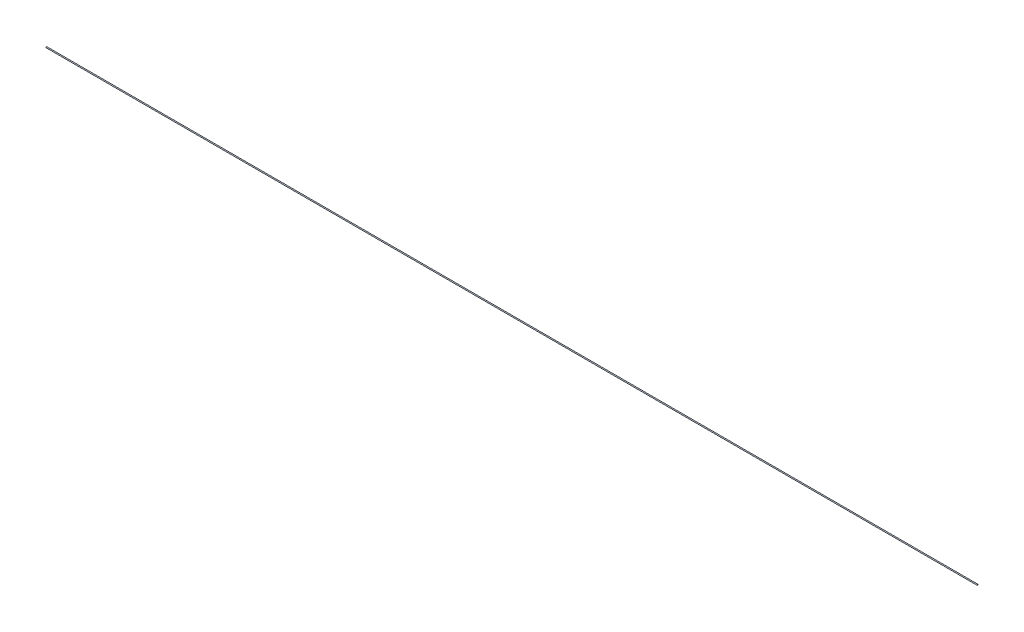
ISO-10303-21;
HEADER;
FILE_DESCRIPTION(('STEP AP214'),'2;1');
FILE_NAME('part.step','',(''),(''),'','','');
FILE_SCHEMA(('AUTOMOTIVE_DESIGN { 1 0 10303 214 1 1 1 1 }'));
ENDSEC;
DATA;
#1=APPLICATION_CONTEXT('core data for automotive mechanical design processes');
#2=APPLICATION_PROTOCOL_DEFINITION('international standard','automotive_design',2000,#1);
#3=PRODUCT_CONTEXT('',#1,'mechanical');
#4=PRODUCT('Part','Part','',(#3));
#5=PRODUCT_RELATED_PRODUCT_CATEGORY('part','',(#4));
#6=PRODUCT_DEFINITION_FORMATION('','',#4);
#7=PRODUCT_DEFINITION_CONTEXT('part definition',#1,'design');
#8=PRODUCT_DEFINITION('design','',#6,#7);
#9=PRODUCT_DEFINITION_SHAPE('','',#8);
#10=(LENGTH_UNIT() NAMED_UNIT(*) SI_UNIT(.MILLI.,.METRE.));
#11=(NAMED_UNIT(*) PLANE_ANGLE_UNIT() SI_UNIT($,.RADIAN.));
#12=(NAMED_UNIT(*) SI_UNIT($,.STERADIAN.) SOLID_ANGLE_UNIT());
#13=UNCERTAINTY_MEASURE_WITH_UNIT(LENGTH_MEASURE(1.E-05),#10,'distance_accuracy_value','');
#14=(GEOMETRIC_REPRESENTATION_CONTEXT(3) GLOBAL_UNCERTAINTY_ASSIGNED_CONTEXT((#13)) GLOBAL_UNIT_ASSIGNED_CONTEXT((#10,
#11,#12)) REPRESENTATION_CONTEXT('',''));
#15=CARTESIAN_POINT('',(0.,0.,0.));
#16=DIRECTION('',(0.,0.,1.));
#17=DIRECTION('',(1.,0.,0.));
#18=AXIS2_PLACEMENT_3D('',#15,#16,#17);
#19=CARTESIAN_POINT('',(10000.,0.,0.));
#20=DIRECTION('',(-1.,0.,0.));
#21=DIRECTION('',(0.,0.,1.));
#22=AXIS2_PLACEMENT_3D('',#19,#20,#21);
#23=CYLINDRICAL_SURFACE('',#22,5.);
#24=CARTESIAN_POINT('',(10000.,0.,0.));
#25=DIRECTION('',(1.,0.,0.));
#26=DIRECTION('',(0.,0.,-1.));
#27=AXIS2_PLACEMENT_3D('',#24,#25,#26);
#28=CIRCLE('',#27,5.);
#29=CARTESIAN_POINT('',(10000.,0.,-5.));
#30=VERTEX_POINT('',#29);
#31=EDGE_CURVE('E10',#30,#30,#28,.T.);
#32=ORIENTED_EDGE('',*,*,#31,.F.);
#33=EDGE_LOOP('',(#32));
#34=FACE_BOUND('',#33,.T.);
#35=CARTESIAN_POINT('',(0.,0.,0.));
#36=DIRECTION('',(1.,0.,0.));
#37=DIRECTION('',(0.,0.,-1.));
#38=AXIS2_PLACEMENT_3D('',#35,#36,#37);
#39=CIRCLE('',#38,5.);
#40=CARTESIAN_POINT('',(0.,0.,-5.));
#41=VERTEX_POINT('',#40);
#42=EDGE_CURVE('E34',#41,#41,#39,.T.);
#43=ORIENTED_EDGE('',*,*,#42,.T.);
#44=EDGE_LOOP('',(#43));
#45=FACE_BOUND('',#44,.T.);
#46=ADVANCED_FACE('F31',(#34,#45),#23,.T.);
#47=CARTESIAN_POINT('',(10000.,0.,0.));
#48=DIRECTION('',(1.,0.,0.));
#49=DIRECTION('',(0.,0.,-1.));
#50=AXIS2_PLACEMENT_3D('',#47,#48,#49);
#51=PLANE('',#50);
#52=ORIENTED_EDGE('',*,*,#31,.T.);
#53=EDGE_LOOP('',(#52));
#54=FACE_BOUND('',#53,.T.);
#55=ADVANCED_FACE('F46',(#54),#51,.T.);
#56=CARTESIAN_POINT('',(0.,0.,0.));
#57=DIRECTION('',(1.,0.,0.));
#58=DIRECTION('',(0.,0.,-1.));
#59=AXIS2_PLACEMENT_3D('',#56,#57,#58);
#60=PLANE('',#59);
#61=ORIENTED_EDGE('',*,*,#42,.F.);
#62=EDGE_LOOP('',(#61));
#63=FACE_BOUND('',#62,.T.);
#64=ADVANCED_FACE('F44',(#63),#60,.F.);
#65=CLOSED_SHELL('',(#46,#55,#64));
#66=MANIFOLD_SOLID_BREP('B2',#65);
#67=ADVANCED_BREP_SHAPE_REPRESENTATION('',(#18,#66),#14);
#68=SHAPE_DEFINITION_REPRESENTATION(#9,#67);
ENDSEC;
END-ISO-10303-21;
